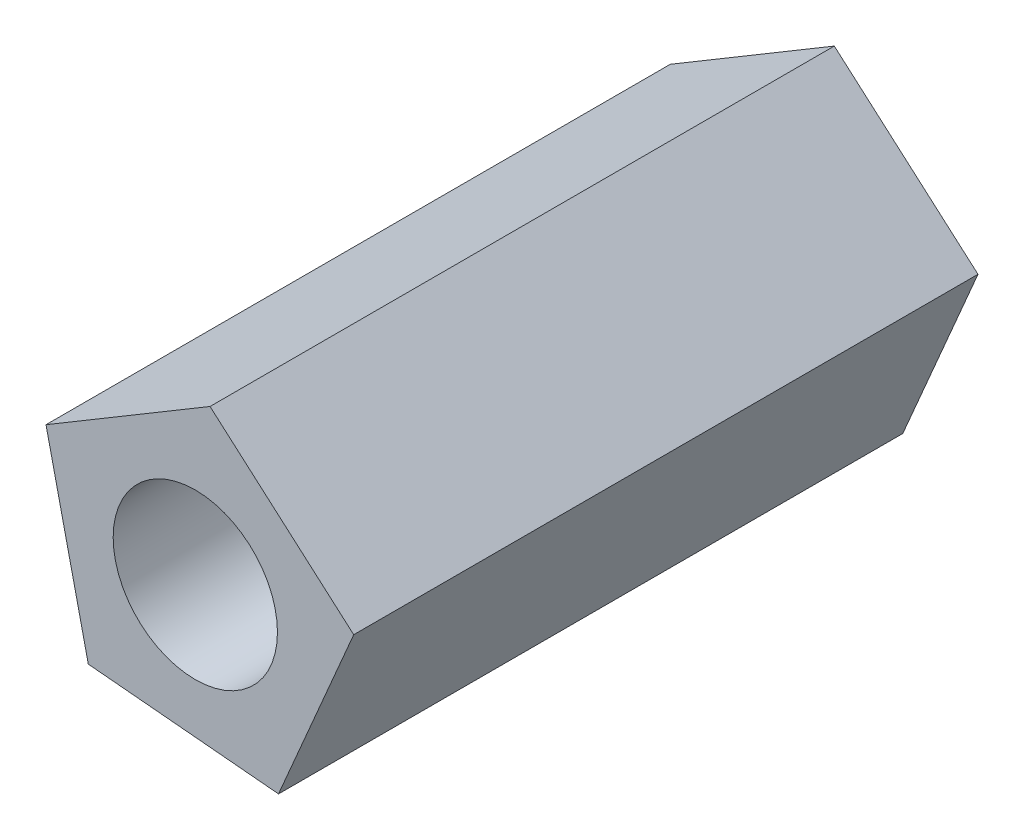
ISO-10303-21;
HEADER;
FILE_DESCRIPTION(('STEP AP214'),'2;1');
FILE_NAME('part.step','',(''),(''),'','','');
FILE_SCHEMA(('AUTOMOTIVE_DESIGN { 1 0 10303 214 1 1 1 1 }'));
ENDSEC;
DATA;
#1=APPLICATION_CONTEXT('core data for automotive mechanical design processes');
#2=APPLICATION_PROTOCOL_DEFINITION('international standard','automotive_design',2000,#1);
#3=PRODUCT_CONTEXT('',#1,'mechanical');
#4=PRODUCT('Part','Part','',(#3));
#5=PRODUCT_RELATED_PRODUCT_CATEGORY('part','',(#4));
#6=PRODUCT_DEFINITION_FORMATION('','',#4);
#7=PRODUCT_DEFINITION_CONTEXT('part definition',#1,'design');
#8=PRODUCT_DEFINITION('design','',#6,#7);
#9=PRODUCT_DEFINITION_SHAPE('','',#8);
#10=(LENGTH_UNIT() NAMED_UNIT(*) SI_UNIT(.MILLI.,.METRE.));
#11=(NAMED_UNIT(*) PLANE_ANGLE_UNIT() SI_UNIT($,.RADIAN.));
#12=(NAMED_UNIT(*) SI_UNIT($,.STERADIAN.) SOLID_ANGLE_UNIT());
#13=UNCERTAINTY_MEASURE_WITH_UNIT(LENGTH_MEASURE(1.E-05),#10,'distance_accuracy_value','');
#14=(GEOMETRIC_REPRESENTATION_CONTEXT(3) GLOBAL_UNCERTAINTY_ASSIGNED_CONTEXT((#13)) GLOBAL_UNIT_ASSIGNED_CONTEXT((#10,
#11,#12)) REPRESENTATION_CONTEXT('',''));
#15=CARTESIAN_POINT('',(0.,0.,0.));
#16=DIRECTION('',(0.,0.,1.));
#17=DIRECTION('',(1.,0.,0.));
#18=AXIS2_PLACEMENT_3D('',#15,#16,#17);
#19=CARTESIAN_POINT('',(0.,0.,14.25));
#20=DIRECTION('',(0.,0.,1.));
#21=DIRECTION('',(1.,0.,0.));
#22=AXIS2_PLACEMENT_3D('',#19,#20,#21);
#23=PLANE('',#22);
#24=DIRECTION('',(-0.752435706118176,0.658665702886102,0.));
#25=VECTOR('',#24,1.);
#26=CARTESIAN_POINT('',(2.4106844859414,0.54777412246576,14.25));
#27=LINE('',#26,#25);
#28=CARTESIAN_POINT('',(2.4106844859414,0.54777412246576,14.25));
#29=VERTEX_POINT('',#28);
#30=CARTESIAN_POINT('',(0.223978325603007,2.46196870200694,14.25));
#31=VERTEX_POINT('',#30);
#32=EDGE_CURVE('E119',#29,#31,#27,.T.);
#33=ORIENTED_EDGE('',*,*,#32,.T.);
#34=DIRECTION('',(-0.858943729154984,-0.512069985593111,0.));
#35=VECTOR('',#34,1.);
#36=CARTESIAN_POINT('',(0.223978325603007,2.46196870200694,14.25));
#37=LINE('',#36,#35);
#38=CARTESIAN_POINT('',(-2.27225826797545,0.973806214612994,14.25));
#39=VERTEX_POINT('',#38);
#40=EDGE_CURVE('E86',#31,#39,#37,.T.);
#41=ORIENTED_EDGE('',*,*,#40,.T.);
#42=DIRECTION('',(0.221579287076811,-0.975142358601313,0.));
#43=VECTOR('',#42,1.);
#44=CARTESIAN_POINT('',(-2.27225826797545,0.973806214612994,14.25));
#45=LINE('',#44,#43);
#46=CARTESIAN_POINT('',(-1.6283111664298,-1.86012336292024,14.25));
#47=VERTEX_POINT('',#46);
#48=EDGE_CURVE('E90',#39,#47,#45,.T.);
#49=ORIENTED_EDGE('',*,*,#48,.T.);
#50=DIRECTION('',(0.995887259771424,-0.0906011358922389,0.));
#51=VECTOR('',#50,1.);
#52=CARTESIAN_POINT('',(-1.6283111664298,-1.86012336292024,14.25));
#53=LINE('',#52,#51);
#54=CARTESIAN_POINT('',(1.26590662286085,-2.12342567616546,14.25));
#55=VERTEX_POINT('',#54);
#56=EDGE_CURVE('E94',#47,#55,#53,.T.);
#57=ORIENTED_EDGE('',*,*,#56,.T.);
#58=DIRECTION('',(0.393912888424924,0.919147777200561,0.));
#59=VECTOR('',#58,1.);
#60=CARTESIAN_POINT('',(1.26590662286085,-2.12342567616546,14.25));
#61=LINE('',#60,#59);
#62=EDGE_CURVE('E52',#55,#29,#61,.T.);
#63=ORIENTED_EDGE('',*,*,#62,.T.);
#64=EDGE_LOOP('',(#33,#41,#49,#57,#63));
#65=FACE_BOUND('',#64,.T.);
#66=CARTESIAN_POINT('',(0.,0.,14.25));
#67=DIRECTION('',(0.,0.,1.));
#68=DIRECTION('',(1.,0.,0.));
#69=AXIS2_PLACEMENT_3D('',#66,#67,#68);
#70=CIRCLE('',#69,1.25);
#71=CARTESIAN_POINT('',(1.25,0.,14.25));
#72=VERTEX_POINT('',#71);
#73=EDGE_CURVE('E114',#72,#72,#70,.T.);
#74=ORIENTED_EDGE('',*,*,#73,.F.);
#75=EDGE_LOOP('',(#74));
#76=FACE_BOUND('',#75,.T.);
#77=ADVANCED_FACE('F35',(#65,#76),#23,.T.);
#78=CARTESIAN_POINT('',(0.,0.,4.75));
#79=DIRECTION('',(0.,0.,1.));
#80=DIRECTION('',(1.,0.,0.));
#81=AXIS2_PLACEMENT_3D('',#78,#79,#80);
#82=PLANE('',#81);
#83=DIRECTION('',(-0.752435706118176,0.658665702886102,0.));
#84=VECTOR('',#83,1.);
#85=CARTESIAN_POINT('',(2.4106844859414,0.54777412246576,4.75));
#86=LINE('',#85,#84);
#87=CARTESIAN_POINT('',(2.4106844859414,0.54777412246576,4.75));
#88=VERTEX_POINT('',#87);
#89=CARTESIAN_POINT('',(0.223978325603007,2.46196870200694,4.75));
#90=VERTEX_POINT('',#89);
#91=EDGE_CURVE('E110',#88,#90,#86,.T.);
#92=ORIENTED_EDGE('',*,*,#91,.F.);
#93=DIRECTION('',(0.393912888424924,0.919147777200561,0.));
#94=VECTOR('',#93,1.);
#95=CARTESIAN_POINT('',(1.26590662286085,-2.12342567616546,4.75));
#96=LINE('',#95,#94);
#97=CARTESIAN_POINT('',(1.26590662286085,-2.12342567616546,4.75));
#98=VERTEX_POINT('',#97);
#99=EDGE_CURVE('E78',#98,#88,#96,.T.);
#100=ORIENTED_EDGE('',*,*,#99,.F.);
#101=DIRECTION('',(0.995887259771424,-0.0906011358922389,0.));
#102=VECTOR('',#101,1.);
#103=CARTESIAN_POINT('',(-1.6283111664298,-1.86012336292024,4.75));
#104=LINE('',#103,#102);
#105=CARTESIAN_POINT('',(-1.6283111664298,-1.86012336292024,4.75));
#106=VERTEX_POINT('',#105);
#107=EDGE_CURVE('E72',#106,#98,#104,.T.);
#108=ORIENTED_EDGE('',*,*,#107,.F.);
#109=DIRECTION('',(0.221579287076811,-0.975142358601313,0.));
#110=VECTOR('',#109,1.);
#111=CARTESIAN_POINT('',(-2.27225826797545,0.973806214612994,4.75));
#112=LINE('',#111,#110);
#113=CARTESIAN_POINT('',(-2.27225826797545,0.973806214612994,4.75));
#114=VERTEX_POINT('',#113);
#115=EDGE_CURVE('E101',#114,#106,#112,.T.);
#116=ORIENTED_EDGE('',*,*,#115,.F.);
#117=DIRECTION('',(-0.858943729154984,-0.512069985593111,0.));
#118=VECTOR('',#117,1.);
#119=CARTESIAN_POINT('',(0.223978325603007,2.46196870200694,4.75));
#120=LINE('',#119,#118);
#121=EDGE_CURVE('E113',#90,#114,#120,.T.);
#122=ORIENTED_EDGE('',*,*,#121,.F.);
#123=EDGE_LOOP('',(#92,#100,#108,#116,#122));
#124=FACE_BOUND('',#123,.T.);
#125=CARTESIAN_POINT('',(0.,0.,4.75));
#126=DIRECTION('',(0.,0.,1.));
#127=DIRECTION('',(1.,0.,0.));
#128=AXIS2_PLACEMENT_3D('',#125,#126,#127);
#129=CIRCLE('',#128,1.25);
#130=CARTESIAN_POINT('',(1.25,0.,4.75));
#131=VERTEX_POINT('',#130);
#132=EDGE_CURVE('E199',#131,#131,#129,.T.);
#133=ORIENTED_EDGE('',*,*,#132,.T.);
#134=EDGE_LOOP('',(#133));
#135=FACE_BOUND('',#134,.T.);
#136=ADVANCED_FACE('F123',(#124,#135),#82,.F.);
#137=CARTESIAN_POINT('',(2.4106844859414,0.54777412246576,14.25));
#138=DIRECTION('',(-0.658665702886102,-0.752435706118176,0.));
#139=DIRECTION('',(0.752435706118176,-0.658665702886102,0.));
#140=AXIS2_PLACEMENT_3D('',#137,#138,#139);
#141=PLANE('',#140);
#142=ORIENTED_EDGE('',*,*,#91,.T.);
#143=DIRECTION('',(0.,0.,-1.));
#144=VECTOR('',#143,1.);
#145=CARTESIAN_POINT('',(0.223978325603007,2.46196870200694,14.25));
#146=LINE('',#145,#144);
#147=EDGE_CURVE('E11',#31,#90,#146,.T.);
#148=ORIENTED_EDGE('',*,*,#147,.F.);
#149=ORIENTED_EDGE('',*,*,#32,.F.);
#150=DIRECTION('',(0.,0.,-1.));
#151=VECTOR('',#150,1.);
#152=CARTESIAN_POINT('',(2.4106844859414,0.54777412246576,14.25));
#153=LINE('',#152,#151);
#154=EDGE_CURVE('E106',#29,#88,#153,.T.);
#155=ORIENTED_EDGE('',*,*,#154,.T.);
#156=EDGE_LOOP('',(#142,#148,#149,#155));
#157=FACE_BOUND('',#156,.T.);
#158=ADVANCED_FACE('F37',(#157),#141,.F.);
#159=CARTESIAN_POINT('',(0.223978325603007,2.46196870200694,14.25));
#160=DIRECTION('',(0.512069985593111,-0.858943729154984,0.));
#161=DIRECTION('',(0.858943729154984,0.512069985593111,0.));
#162=AXIS2_PLACEMENT_3D('',#159,#160,#161);
#163=PLANE('',#162);
#164=ORIENTED_EDGE('',*,*,#121,.T.);
#165=DIRECTION('',(0.,0.,-1.));
#166=VECTOR('',#165,1.);
#167=CARTESIAN_POINT('',(-2.27225826797545,0.973806214612994,14.25));
#168=LINE('',#167,#166);
#169=EDGE_CURVE('E44',#39,#114,#168,.T.);
#170=ORIENTED_EDGE('',*,*,#169,.F.);
#171=ORIENTED_EDGE('',*,*,#40,.F.);
#172=ORIENTED_EDGE('',*,*,#147,.T.);
#173=EDGE_LOOP('',(#164,#170,#171,#172));
#174=FACE_BOUND('',#173,.T.);
#175=ADVANCED_FACE('F148',(#174),#163,.F.);
#176=CARTESIAN_POINT('',(-2.27225826797545,0.973806214612994,14.25));
#177=DIRECTION('',(0.975142358601313,0.221579287076811,0.));
#178=DIRECTION('',(-0.221579287076811,0.975142358601313,0.));
#179=AXIS2_PLACEMENT_3D('',#176,#177,#178);
#180=PLANE('',#179);
#181=ORIENTED_EDGE('',*,*,#115,.T.);
#182=DIRECTION('',(0.,0.,-1.));
#183=VECTOR('',#182,1.);
#184=CARTESIAN_POINT('',(-1.6283111664298,-1.86012336292024,14.25));
#185=LINE('',#184,#183);
#186=EDGE_CURVE('E98',#47,#106,#185,.T.);
#187=ORIENTED_EDGE('',*,*,#186,.F.);
#188=ORIENTED_EDGE('',*,*,#48,.F.);
#189=ORIENTED_EDGE('',*,*,#169,.T.);
#190=EDGE_LOOP('',(#181,#187,#188,#189));
#191=FACE_BOUND('',#190,.T.);
#192=ADVANCED_FACE('F99',(#191),#180,.F.);
#193=CARTESIAN_POINT('',(-1.6283111664298,-1.86012336292024,14.25));
#194=DIRECTION('',(0.0906011358922389,0.995887259771424,0.));
#195=DIRECTION('',(-0.995887259771424,0.0906011358922389,0.));
#196=AXIS2_PLACEMENT_3D('',#193,#194,#195);
#197=PLANE('',#196);
#198=ORIENTED_EDGE('',*,*,#107,.T.);
#199=DIRECTION('',(0.,0.,-1.));
#200=VECTOR('',#199,1.);
#201=CARTESIAN_POINT('',(1.26590662286085,-2.12342567616546,14.25));
#202=LINE('',#201,#200);
#203=EDGE_CURVE('E102',#55,#98,#202,.T.);
#204=ORIENTED_EDGE('',*,*,#203,.F.);
#205=ORIENTED_EDGE('',*,*,#56,.F.);
#206=ORIENTED_EDGE('',*,*,#186,.T.);
#207=EDGE_LOOP('',(#198,#204,#205,#206));
#208=FACE_BOUND('',#207,.T.);
#209=ADVANCED_FACE('F104',(#208),#197,.F.);
#210=CARTESIAN_POINT('',(1.26590662286085,-2.12342567616546,14.25));
#211=DIRECTION('',(-0.919147777200562,0.393912888424925,0.));
#212=DIRECTION('',(-0.393912888424925,-0.919147777200562,0.));
#213=AXIS2_PLACEMENT_3D('',#210,#211,#212);
#214=PLANE('',#213);
#215=ORIENTED_EDGE('',*,*,#99,.T.);
#216=ORIENTED_EDGE('',*,*,#154,.F.);
#217=ORIENTED_EDGE('',*,*,#62,.F.);
#218=ORIENTED_EDGE('',*,*,#203,.T.);
#219=EDGE_LOOP('',(#215,#216,#217,#218));
#220=FACE_BOUND('',#219,.T.);
#221=ADVANCED_FACE('F128',(#220),#214,.F.);
#222=CARTESIAN_POINT('',(0.,0.,14.25));
#223=DIRECTION('',(0.,0.,-1.));
#224=DIRECTION('',(-1.,0.,0.));
#225=AXIS2_PLACEMENT_3D('',#222,#223,#224);
#226=CYLINDRICAL_SURFACE('',#225,1.25);
#227=ORIENTED_EDGE('',*,*,#73,.T.);
#228=EDGE_LOOP('',(#227));
#229=FACE_BOUND('',#228,.T.);
#230=ORIENTED_EDGE('',*,*,#132,.F.);
#231=EDGE_LOOP('',(#230));
#232=FACE_BOUND('',#231,.T.);
#233=ADVANCED_FACE('F130',(#229,#232),#226,.F.);
#234=CLOSED_SHELL('',(#77,#136,#158,#175,#192,#209,#221,#233));
#235=MANIFOLD_SOLID_BREP('B2',#234);
#236=ADVANCED_BREP_SHAPE_REPRESENTATION('',(#18,#235),#14);
#237=SHAPE_DEFINITION_REPRESENTATION(#9,#236);
ENDSEC;
END-ISO-10303-21;
